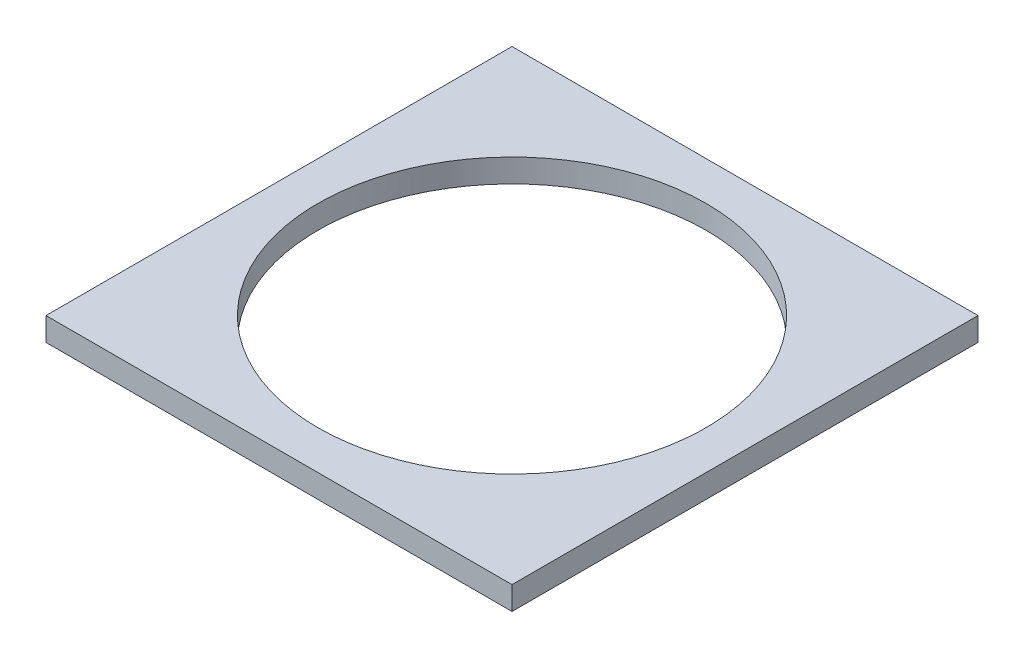
ISO-10303-21;
HEADER;
FILE_DESCRIPTION(('STEP AP214'),'2;1');
FILE_NAME('part.step','',(''),(''),'','','');
FILE_SCHEMA(('AUTOMOTIVE_DESIGN { 1 0 10303 214 1 1 1 1 }'));
ENDSEC;
DATA;
#1=APPLICATION_CONTEXT('core data for automotive mechanical design processes');
#2=APPLICATION_PROTOCOL_DEFINITION('international standard','automotive_design',2000,#1);
#3=PRODUCT_CONTEXT('',#1,'mechanical');
#4=PRODUCT('Part','Part','',(#3));
#5=PRODUCT_RELATED_PRODUCT_CATEGORY('part','',(#4));
#6=PRODUCT_DEFINITION_FORMATION('','',#4);
#7=PRODUCT_DEFINITION_CONTEXT('part definition',#1,'design');
#8=PRODUCT_DEFINITION('design','',#6,#7);
#9=PRODUCT_DEFINITION_SHAPE('','',#8);
#10=(LENGTH_UNIT() NAMED_UNIT(*) SI_UNIT(.MILLI.,.METRE.));
#11=(NAMED_UNIT(*) PLANE_ANGLE_UNIT() SI_UNIT($,.RADIAN.));
#12=(NAMED_UNIT(*) SI_UNIT($,.STERADIAN.) SOLID_ANGLE_UNIT());
#13=UNCERTAINTY_MEASURE_WITH_UNIT(LENGTH_MEASURE(1.E-05),#10,'distance_accuracy_value','');
#14=(GEOMETRIC_REPRESENTATION_CONTEXT(3) GLOBAL_UNCERTAINTY_ASSIGNED_CONTEXT((#13)) GLOBAL_UNIT_ASSIGNED_CONTEXT((#10,
#11,#12)) REPRESENTATION_CONTEXT('',''));
#15=CARTESIAN_POINT('',(0.,0.,0.));
#16=DIRECTION('',(0.,0.,1.));
#17=DIRECTION('',(1.,0.,0.));
#18=AXIS2_PLACEMENT_3D('',#15,#16,#17);
#19=CARTESIAN_POINT('',(0.,7.62,0.));
#20=DIRECTION('',(0.,1.,0.));
#21=DIRECTION('',(0.,0.,1.));
#22=AXIS2_PLACEMENT_3D('',#19,#20,#21);
#23=PLANE('',#22);
#24=DIRECTION('',(0.,0.,-1.));
#25=VECTOR('',#24,1.);
#26=CARTESIAN_POINT('',(76.2,7.62,-76.2));
#27=LINE('',#26,#25);
#28=CARTESIAN_POINT('',(76.2,7.62,76.2));
#29=VERTEX_POINT('',#28);
#30=CARTESIAN_POINT('',(76.2,7.62,-76.2));
#31=VERTEX_POINT('',#30);
#32=EDGE_CURVE('E91',#29,#31,#27,.T.);
#33=ORIENTED_EDGE('',*,*,#32,.T.);
#34=DIRECTION('',(-1.,0.,0.));
#35=VECTOR('',#34,1.);
#36=CARTESIAN_POINT('',(-76.2,7.62,-76.2));
#37=LINE('',#36,#35);
#38=CARTESIAN_POINT('',(-76.2,7.62,-76.2));
#39=VERTEX_POINT('',#38);
#40=EDGE_CURVE('E86',#31,#39,#37,.T.);
#41=ORIENTED_EDGE('',*,*,#40,.T.);
#42=DIRECTION('',(0.,0.,1.));
#43=VECTOR('',#42,1.);
#44=CARTESIAN_POINT('',(-76.2,7.62,-76.2));
#45=LINE('',#44,#43);
#46=CARTESIAN_POINT('',(-76.2,7.62,76.2));
#47=VERTEX_POINT('',#46);
#48=EDGE_CURVE('E89',#39,#47,#45,.T.);
#49=ORIENTED_EDGE('',*,*,#48,.T.);
#50=DIRECTION('',(1.,0.,0.));
#51=VECTOR('',#50,1.);
#52=CARTESIAN_POINT('',(-76.2,7.62,76.2));
#53=LINE('',#52,#51);
#54=EDGE_CURVE('E56',#47,#29,#53,.T.);
#55=ORIENTED_EDGE('',*,*,#54,.T.);
#56=EDGE_LOOP('',(#33,#41,#49,#55));
#57=FACE_BOUND('',#56,.T.);
#58=CARTESIAN_POINT('',(0.,7.62,0.));
#59=DIRECTION('',(0.,1.,0.));
#60=DIRECTION('',(0.,0.,1.));
#61=AXIS2_PLACEMENT_3D('',#58,#59,#60);
#62=CIRCLE('',#61,63.5);
#63=CARTESIAN_POINT('',(0.,7.62,63.5));
#64=VERTEX_POINT('',#63);
#65=EDGE_CURVE('E106',#64,#64,#62,.T.);
#66=ORIENTED_EDGE('',*,*,#65,.F.);
#67=EDGE_LOOP('',(#66));
#68=FACE_BOUND('',#67,.T.);
#69=ADVANCED_FACE('F39',(#57,#68),#23,.T.);
#70=CARTESIAN_POINT('',(0.,0.,0.));
#71=DIRECTION('',(0.,1.,0.));
#72=DIRECTION('',(0.,0.,1.));
#73=AXIS2_PLACEMENT_3D('',#70,#71,#72);
#74=PLANE('',#73);
#75=DIRECTION('',(0.,0.,-1.));
#76=VECTOR('',#75,1.);
#77=CARTESIAN_POINT('',(76.2,0.,-76.2));
#78=LINE('',#77,#76);
#79=CARTESIAN_POINT('',(76.2,0.,76.2));
#80=VERTEX_POINT('',#79);
#81=CARTESIAN_POINT('',(76.2,0.,-76.2));
#82=VERTEX_POINT('',#81);
#83=EDGE_CURVE('E103',#80,#82,#78,.T.);
#84=ORIENTED_EDGE('',*,*,#83,.F.);
#85=DIRECTION('',(1.,0.,0.));
#86=VECTOR('',#85,1.);
#87=CARTESIAN_POINT('',(-76.2,0.,76.2));
#88=LINE('',#87,#86);
#89=CARTESIAN_POINT('',(-76.2,0.,76.2));
#90=VERTEX_POINT('',#89);
#91=EDGE_CURVE('E79',#90,#80,#88,.T.);
#92=ORIENTED_EDGE('',*,*,#91,.F.);
#93=DIRECTION('',(0.,0.,1.));
#94=VECTOR('',#93,1.);
#95=CARTESIAN_POINT('',(-76.2,0.,-76.2));
#96=LINE('',#95,#94);
#97=CARTESIAN_POINT('',(-76.2,0.,-76.2));
#98=VERTEX_POINT('',#97);
#99=EDGE_CURVE('E73',#98,#90,#96,.T.);
#100=ORIENTED_EDGE('',*,*,#99,.F.);
#101=DIRECTION('',(-1.,0.,0.));
#102=VECTOR('',#101,1.);
#103=CARTESIAN_POINT('',(-76.2,0.,-76.2));
#104=LINE('',#103,#102);
#105=EDGE_CURVE('E95',#82,#98,#104,.T.);
#106=ORIENTED_EDGE('',*,*,#105,.F.);
#107=EDGE_LOOP('',(#84,#92,#100,#106));
#108=FACE_BOUND('',#107,.T.);
#109=CARTESIAN_POINT('',(0.,0.,0.));
#110=DIRECTION('',(0.,1.,0.));
#111=DIRECTION('',(0.,0.,1.));
#112=AXIS2_PLACEMENT_3D('',#109,#110,#111);
#113=CIRCLE('',#112,63.5);
#114=CARTESIAN_POINT('',(0.,0.,63.5));
#115=VERTEX_POINT('',#114);
#116=EDGE_CURVE('E118',#115,#115,#113,.T.);
#117=ORIENTED_EDGE('',*,*,#116,.T.);
#118=EDGE_LOOP('',(#117));
#119=FACE_BOUND('',#118,.T.);
#120=ADVANCED_FACE('F114',(#108,#119),#74,.F.);
#121=CARTESIAN_POINT('',(76.2,7.62,-76.2));
#122=DIRECTION('',(-1.,0.,0.));
#123=DIRECTION('',(0.,0.,1.));
#124=AXIS2_PLACEMENT_3D('',#121,#122,#123);
#125=PLANE('',#124);
#126=ORIENTED_EDGE('',*,*,#83,.T.);
#127=DIRECTION('',(0.,-1.,0.));
#128=VECTOR('',#127,1.);
#129=CARTESIAN_POINT('',(76.2,7.62,-76.2));
#130=LINE('',#129,#128);
#131=EDGE_CURVE('E11',#31,#82,#130,.T.);
#132=ORIENTED_EDGE('',*,*,#131,.F.);
#133=ORIENTED_EDGE('',*,*,#32,.F.);
#134=DIRECTION('',(0.,-1.,0.));
#135=VECTOR('',#134,1.);
#136=CARTESIAN_POINT('',(76.2,7.62,76.2));
#137=LINE('',#136,#135);
#138=EDGE_CURVE('E99',#29,#80,#137,.T.);
#139=ORIENTED_EDGE('',*,*,#138,.T.);
#140=EDGE_LOOP('',(#126,#132,#133,#139));
#141=FACE_BOUND('',#140,.T.);
#142=ADVANCED_FACE('F41',(#141),#125,.F.);
#143=CARTESIAN_POINT('',(-76.2,7.62,-76.2));
#144=DIRECTION('',(0.,0.,1.));
#145=DIRECTION('',(1.,0.,0.));
#146=AXIS2_PLACEMENT_3D('',#143,#144,#145);
#147=PLANE('',#146);
#148=ORIENTED_EDGE('',*,*,#105,.T.);
#149=DIRECTION('',(0.,-1.,0.));
#150=VECTOR('',#149,1.);
#151=CARTESIAN_POINT('',(-76.2,7.62,-76.2));
#152=LINE('',#151,#150);
#153=EDGE_CURVE('E48',#39,#98,#152,.T.);
#154=ORIENTED_EDGE('',*,*,#153,.F.);
#155=ORIENTED_EDGE('',*,*,#40,.F.);
#156=ORIENTED_EDGE('',*,*,#131,.T.);
#157=EDGE_LOOP('',(#148,#154,#155,#156));
#158=FACE_BOUND('',#157,.T.);
#159=ADVANCED_FACE('F94',(#158),#147,.F.);
#160=CARTESIAN_POINT('',(-76.2,7.62,-76.2));
#161=DIRECTION('',(1.,0.,0.));
#162=DIRECTION('',(0.,0.,-1.));
#163=AXIS2_PLACEMENT_3D('',#160,#161,#162);
#164=PLANE('',#163);
#165=ORIENTED_EDGE('',*,*,#99,.T.);
#166=DIRECTION('',(0.,-1.,0.));
#167=VECTOR('',#166,1.);
#168=CARTESIAN_POINT('',(-76.2,7.62,76.2));
#169=LINE('',#168,#167);
#170=EDGE_CURVE('E96',#47,#90,#169,.T.);
#171=ORIENTED_EDGE('',*,*,#170,.F.);
#172=ORIENTED_EDGE('',*,*,#48,.F.);
#173=ORIENTED_EDGE('',*,*,#153,.T.);
#174=EDGE_LOOP('',(#165,#171,#172,#173));
#175=FACE_BOUND('',#174,.T.);
#176=ADVANCED_FACE('F97',(#175),#164,.F.);
#177=CARTESIAN_POINT('',(-76.2,7.62,76.2));
#178=DIRECTION('',(0.,0.,-1.));
#179=DIRECTION('',(-1.,0.,0.));
#180=AXIS2_PLACEMENT_3D('',#177,#178,#179);
#181=PLANE('',#180);
#182=ORIENTED_EDGE('',*,*,#91,.T.);
#183=ORIENTED_EDGE('',*,*,#138,.F.);
#184=ORIENTED_EDGE('',*,*,#54,.F.);
#185=ORIENTED_EDGE('',*,*,#170,.T.);
#186=EDGE_LOOP('',(#182,#183,#184,#185));
#187=FACE_BOUND('',#186,.T.);
#188=ADVANCED_FACE('F111',(#187),#181,.F.);
#189=CARTESIAN_POINT('',(0.,7.62,0.));
#190=DIRECTION('',(0.,-1.,0.));
#191=DIRECTION('',(0.,0.,-1.));
#192=AXIS2_PLACEMENT_3D('',#189,#190,#191);
#193=CYLINDRICAL_SURFACE('',#192,63.5);
#194=ORIENTED_EDGE('',*,*,#65,.T.);
#195=EDGE_LOOP('',(#194));
#196=FACE_BOUND('',#195,.T.);
#197=ORIENTED_EDGE('',*,*,#116,.F.);
#198=EDGE_LOOP('',(#197));
#199=FACE_BOUND('',#198,.T.);
#200=ADVANCED_FACE('F124',(#196,#199),#193,.F.);
#201=CLOSED_SHELL('',(#69,#120,#142,#159,#176,#188,#200));
#202=MANIFOLD_SOLID_BREP('B2',#201);
#203=ADVANCED_BREP_SHAPE_REPRESENTATION('',(#18,#202),#14);
#204=SHAPE_DEFINITION_REPRESENTATION(#9,#203);
ENDSEC;
END-ISO-10303-21;
